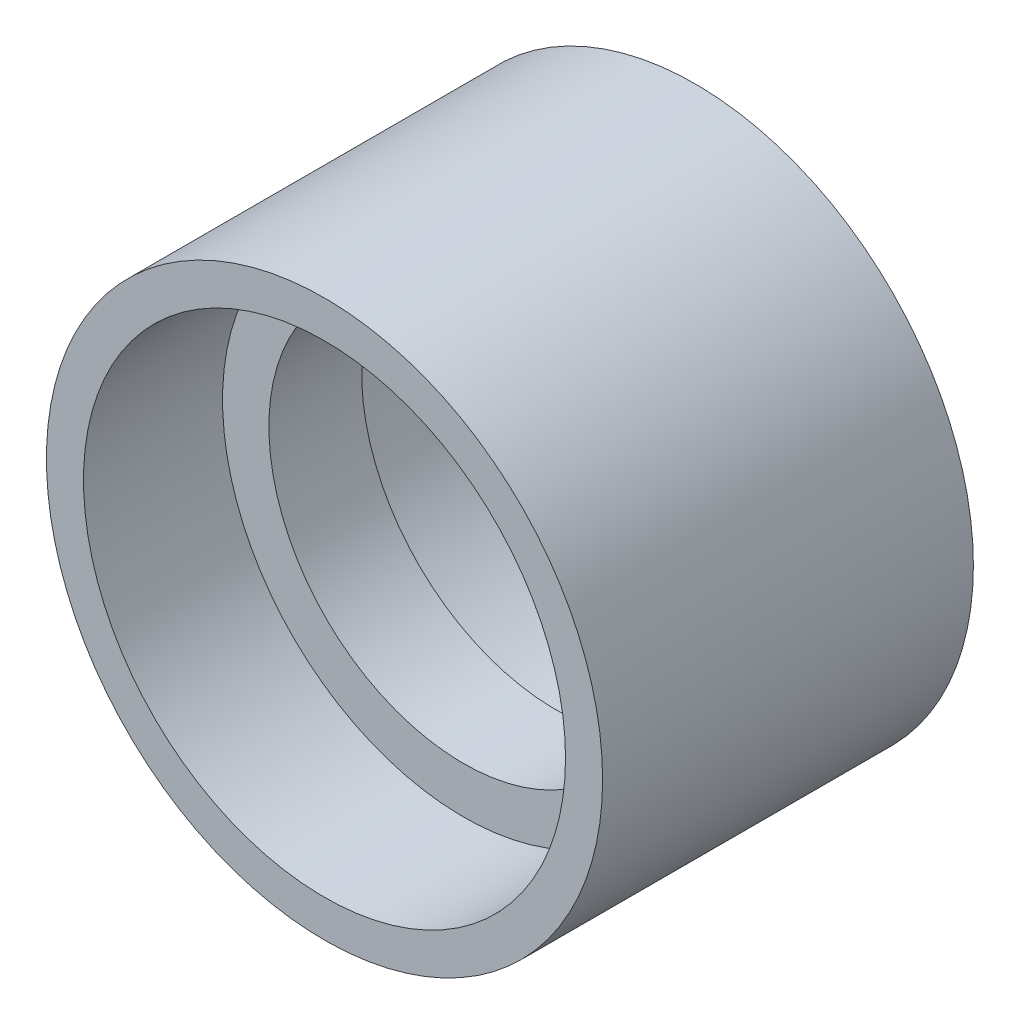
ISO-10303-21;
HEADER;
FILE_DESCRIPTION(('STEP AP214'),'2;1');
FILE_NAME('part.step','',(''),(''),'','','');
FILE_SCHEMA(('AUTOMOTIVE_DESIGN { 1 0 10303 214 1 1 1 1 }'));
ENDSEC;
DATA;
#1=APPLICATION_CONTEXT('core data for automotive mechanical design processes');
#2=APPLICATION_PROTOCOL_DEFINITION('international standard','automotive_design',2000,#1);
#3=PRODUCT_CONTEXT('',#1,'mechanical');
#4=PRODUCT('Part','Part','',(#3));
#5=PRODUCT_RELATED_PRODUCT_CATEGORY('part','',(#4));
#6=PRODUCT_DEFINITION_FORMATION('','',#4);
#7=PRODUCT_DEFINITION_CONTEXT('part definition',#1,'design');
#8=PRODUCT_DEFINITION('design','',#6,#7);
#9=PRODUCT_DEFINITION_SHAPE('','',#8);
#10=(LENGTH_UNIT() NAMED_UNIT(*) SI_UNIT(.MILLI.,.METRE.));
#11=(NAMED_UNIT(*) PLANE_ANGLE_UNIT() SI_UNIT($,.RADIAN.));
#12=(NAMED_UNIT(*) SI_UNIT($,.STERADIAN.) SOLID_ANGLE_UNIT());
#13=UNCERTAINTY_MEASURE_WITH_UNIT(LENGTH_MEASURE(1.E-05),#10,'distance_accuracy_value','');
#14=(GEOMETRIC_REPRESENTATION_CONTEXT(3) GLOBAL_UNCERTAINTY_ASSIGNED_CONTEXT((#13)) GLOBAL_UNIT_ASSIGNED_CONTEXT((#10,
#11,#12)) REPRESENTATION_CONTEXT('',''));
#15=CARTESIAN_POINT('',(0.,0.,0.));
#16=DIRECTION('',(0.,0.,1.));
#17=DIRECTION('',(1.,0.,0.));
#18=AXIS2_PLACEMENT_3D('',#15,#16,#17);
#19=CARTESIAN_POINT('',(0.,0.,1000.));
#20=DIRECTION('',(0.,0.,1.));
#21=DIRECTION('',(1.,0.,0.));
#22=AXIS2_PLACEMENT_3D('',#19,#20,#21);
#23=CYLINDRICAL_SURFACE('',#22,30.);
#24=CARTESIAN_POINT('',(0.,0.,-20.));
#25=DIRECTION('',(0.,0.,1.));
#26=DIRECTION('',(1.,0.,0.));
#27=AXIS2_PLACEMENT_3D('',#24,#25,#26);
#28=CIRCLE('',#27,30.);
#29=CARTESIAN_POINT('',(30.,0.,-20.));
#30=VERTEX_POINT('',#29);
#31=EDGE_CURVE('E10',#30,#30,#28,.T.);
#32=ORIENTED_EDGE('',*,*,#31,.T.);
#33=EDGE_LOOP('',(#32));
#34=FACE_BOUND('',#33,.T.);
#35=CARTESIAN_POINT('',(0.,0.,20.));
#36=DIRECTION('',(0.,0.,1.));
#37=DIRECTION('',(1.,0.,0.));
#38=AXIS2_PLACEMENT_3D('',#35,#36,#37);
#39=CIRCLE('',#38,30.);
#40=CARTESIAN_POINT('',(30.,0.,20.));
#41=VERTEX_POINT('',#40);
#42=EDGE_CURVE('E53',#41,#41,#39,.T.);
#43=ORIENTED_EDGE('',*,*,#42,.F.);
#44=EDGE_LOOP('',(#43));
#45=FACE_BOUND('',#44,.T.);
#46=ADVANCED_FACE('F34',(#34,#45),#23,.T.);
#47=CARTESIAN_POINT('',(0.,30.,-20.));
#48=DIRECTION('',(0.,0.,1.));
#49=DIRECTION('',(1.,0.,0.));
#50=AXIS2_PLACEMENT_3D('',#47,#48,#49);
#51=PLANE('',#50);
#52=ORIENTED_EDGE('',*,*,#31,.F.);
#53=EDGE_LOOP('',(#52));
#54=FACE_BOUND('',#53,.T.);
#55=CARTESIAN_POINT('',(0.,0.,-20.));
#56=DIRECTION('',(0.,0.,1.));
#57=DIRECTION('',(1.,0.,0.));
#58=AXIS2_PLACEMENT_3D('',#55,#56,#57);
#59=CIRCLE('',#58,26.);
#60=CARTESIAN_POINT('',(26.,0.,-20.));
#61=VERTEX_POINT('',#60);
#62=EDGE_CURVE('E40',#61,#61,#59,.T.);
#63=ORIENTED_EDGE('',*,*,#62,.T.);
#64=EDGE_LOOP('',(#63));
#65=FACE_BOUND('',#64,.T.);
#66=ADVANCED_FACE('F80',(#54,#65),#51,.F.);
#67=CARTESIAN_POINT('',(0.,0.,1000.));
#68=DIRECTION('',(0.,0.,1.));
#69=DIRECTION('',(1.,0.,0.));
#70=AXIS2_PLACEMENT_3D('',#67,#68,#69);
#71=CYLINDRICAL_SURFACE('',#70,26.);
#72=ORIENTED_EDGE('',*,*,#62,.F.);
#73=EDGE_LOOP('',(#72));
#74=FACE_BOUND('',#73,.T.);
#75=CARTESIAN_POINT('',(0.,0.,-5.00000000000012));
#76=DIRECTION('',(0.,0.,1.));
#77=DIRECTION('',(1.,0.,0.));
#78=AXIS2_PLACEMENT_3D('',#75,#76,#77);
#79=CIRCLE('',#78,26.);
#80=CARTESIAN_POINT('',(26.,0.,-5.00000000000012));
#81=VERTEX_POINT('',#80);
#82=EDGE_CURVE('E44',#81,#81,#79,.T.);
#83=ORIENTED_EDGE('',*,*,#82,.T.);
#84=EDGE_LOOP('',(#83));
#85=FACE_BOUND('',#84,.T.);
#86=ADVANCED_FACE('F84',(#74,#85),#71,.F.);
#87=CARTESIAN_POINT('',(0.,26.,-5.00000000000006));
#88=DIRECTION('',(0.,0.,1.));
#89=DIRECTION('',(1.,0.,0.));
#90=AXIS2_PLACEMENT_3D('',#87,#88,#89);
#91=PLANE('',#90);
#92=ORIENTED_EDGE('',*,*,#82,.F.);
#93=EDGE_LOOP('',(#92));
#94=FACE_BOUND('',#93,.T.);
#95=CARTESIAN_POINT('',(0.,0.,-5.00000000000012));
#96=DIRECTION('',(0.,0.,1.));
#97=DIRECTION('',(1.,0.,0.));
#98=AXIS2_PLACEMENT_3D('',#95,#96,#97);
#99=CIRCLE('',#98,21.);
#100=CARTESIAN_POINT('',(21.,0.,-5.00000000000012));
#101=VERTEX_POINT('',#100);
#102=EDGE_CURVE('E48',#101,#101,#99,.T.);
#103=ORIENTED_EDGE('',*,*,#102,.T.);
#104=EDGE_LOOP('',(#103));
#105=FACE_BOUND('',#104,.T.);
#106=ADVANCED_FACE('F98',(#94,#105),#91,.F.);
#107=CARTESIAN_POINT('',(0.,0.,1000.));
#108=DIRECTION('',(0.,0.,1.));
#109=DIRECTION('',(1.,0.,0.));
#110=AXIS2_PLACEMENT_3D('',#107,#108,#109);
#111=CYLINDRICAL_SURFACE('',#110,21.);
#112=ORIENTED_EDGE('',*,*,#102,.F.);
#113=EDGE_LOOP('',(#112));
#114=FACE_BOUND('',#113,.T.);
#115=CARTESIAN_POINT('',(0.,0.,5.00000000000012));
#116=DIRECTION('',(0.,0.,1.));
#117=DIRECTION('',(1.,0.,0.));
#118=AXIS2_PLACEMENT_3D('',#115,#116,#117);
#119=CIRCLE('',#118,21.);
#120=CARTESIAN_POINT('',(21.,0.,5.00000000000012));
#121=VERTEX_POINT('',#120);
#122=EDGE_CURVE('E62',#121,#121,#119,.T.);
#123=ORIENTED_EDGE('',*,*,#122,.T.);
#124=EDGE_LOOP('',(#123));
#125=FACE_BOUND('',#124,.T.);
#126=ADVANCED_FACE('F66',(#114,#125),#111,.F.);
#127=CARTESIAN_POINT('',(0.,30.,20.));
#128=DIRECTION('',(0.,0.,-1.));
#129=DIRECTION('',(1.,0.,0.));
#130=AXIS2_PLACEMENT_3D('',#127,#128,#129);
#131=PLANE('',#130);
#132=ORIENTED_EDGE('',*,*,#42,.T.);
#133=EDGE_LOOP('',(#132));
#134=FACE_BOUND('',#133,.T.);
#135=CARTESIAN_POINT('',(0.,0.,20.));
#136=DIRECTION('',(0.,0.,1.));
#137=DIRECTION('',(1.,0.,0.));
#138=AXIS2_PLACEMENT_3D('',#135,#136,#137);
#139=CIRCLE('',#138,26.);
#140=CARTESIAN_POINT('',(26.,0.,20.));
#141=VERTEX_POINT('',#140);
#142=EDGE_CURVE('E56',#141,#141,#139,.T.);
#143=ORIENTED_EDGE('',*,*,#142,.F.);
#144=EDGE_LOOP('',(#143));
#145=FACE_BOUND('',#144,.T.);
#146=ADVANCED_FACE('F76',(#134,#145),#131,.F.);
#147=CARTESIAN_POINT('',(0.,0.,-1000.));
#148=DIRECTION('',(0.,0.,-1.));
#149=DIRECTION('',(1.,0.,0.));
#150=AXIS2_PLACEMENT_3D('',#147,#148,#149);
#151=CYLINDRICAL_SURFACE('',#150,26.);
#152=ORIENTED_EDGE('',*,*,#142,.T.);
#153=EDGE_LOOP('',(#152));
#154=FACE_BOUND('',#153,.T.);
#155=CARTESIAN_POINT('',(0.,0.,5.00000000000012));
#156=DIRECTION('',(0.,0.,1.));
#157=DIRECTION('',(1.,0.,0.));
#158=AXIS2_PLACEMENT_3D('',#155,#156,#157);
#159=CIRCLE('',#158,26.);
#160=CARTESIAN_POINT('',(26.,0.,5.00000000000012));
#161=VERTEX_POINT('',#160);
#162=EDGE_CURVE('E59',#161,#161,#159,.T.);
#163=ORIENTED_EDGE('',*,*,#162,.F.);
#164=EDGE_LOOP('',(#163));
#165=FACE_BOUND('',#164,.T.);
#166=ADVANCED_FACE('F70',(#154,#165),#151,.F.);
#167=CARTESIAN_POINT('',(0.,26.,5.00000000000006));
#168=DIRECTION('',(0.,0.,-1.));
#169=DIRECTION('',(1.,0.,0.));
#170=AXIS2_PLACEMENT_3D('',#167,#168,#169);
#171=PLANE('',#170);
#172=ORIENTED_EDGE('',*,*,#162,.T.);
#173=EDGE_LOOP('',(#172));
#174=FACE_BOUND('',#173,.T.);
#175=ORIENTED_EDGE('',*,*,#122,.F.);
#176=EDGE_LOOP('',(#175));
#177=FACE_BOUND('',#176,.T.);
#178=ADVANCED_FACE('F68',(#174,#177),#171,.F.);
#179=CLOSED_SHELL('',(#46,#66,#86,#106,#126,#146,#166,#178));
#180=MANIFOLD_SOLID_BREP('B2',#179);
#181=ADVANCED_BREP_SHAPE_REPRESENTATION('',(#18,#180),#14);
#182=SHAPE_DEFINITION_REPRESENTATION(#9,#181);
ENDSEC;
END-ISO-10303-21;
